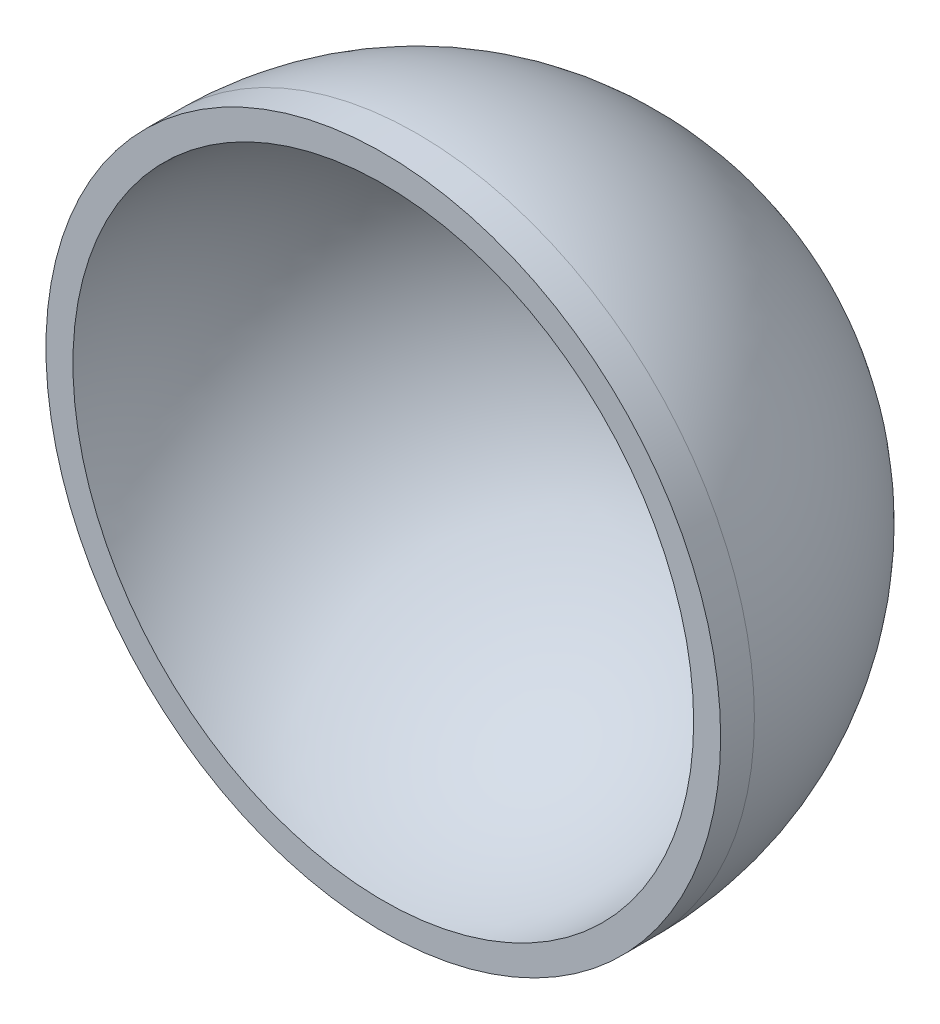
ISO-10303-21;
HEADER;
FILE_DESCRIPTION(('STEP AP214'),'2;1');
FILE_NAME('part.step','',(''),(''),'','','');
FILE_SCHEMA(('AUTOMOTIVE_DESIGN { 1 0 10303 214 1 1 1 1 }'));
ENDSEC;
DATA;
#1=APPLICATION_CONTEXT('core data for automotive mechanical design processes');
#2=APPLICATION_PROTOCOL_DEFINITION('international standard','automotive_design',2000,#1);
#3=PRODUCT_CONTEXT('',#1,'mechanical');
#4=PRODUCT('Part','Part','',(#3));
#5=PRODUCT_RELATED_PRODUCT_CATEGORY('part','',(#4));
#6=PRODUCT_DEFINITION_FORMATION('','',#4);
#7=PRODUCT_DEFINITION_CONTEXT('part definition',#1,'design');
#8=PRODUCT_DEFINITION('design','',#6,#7);
#9=PRODUCT_DEFINITION_SHAPE('','',#8);
#10=(LENGTH_UNIT() NAMED_UNIT(*) SI_UNIT(.MILLI.,.METRE.));
#11=(NAMED_UNIT(*) PLANE_ANGLE_UNIT() SI_UNIT($,.RADIAN.));
#12=(NAMED_UNIT(*) SI_UNIT($,.STERADIAN.) SOLID_ANGLE_UNIT());
#13=UNCERTAINTY_MEASURE_WITH_UNIT(LENGTH_MEASURE(1.E-05),#10,'distance_accuracy_value','');
#14=(GEOMETRIC_REPRESENTATION_CONTEXT(3) GLOBAL_UNCERTAINTY_ASSIGNED_CONTEXT((#13)) GLOBAL_UNIT_ASSIGNED_CONTEXT((#10,
#11,#12)) REPRESENTATION_CONTEXT('',''));
#15=CARTESIAN_POINT('',(0.,0.,0.));
#16=DIRECTION('',(0.,0.,1.));
#17=DIRECTION('',(1.,0.,0.));
#18=AXIS2_PLACEMENT_3D('',#15,#16,#17);
#19=CARTESIAN_POINT('',(0.,0.,-5.));
#20=DIRECTION('',(0.,0.,1.));
#21=DIRECTION('',(1.,0.,0.));
#22=AXIS2_PLACEMENT_3D('',#19,#20,#21);
#23=CYLINDRICAL_SURFACE('',#22,50.);
#24=CARTESIAN_POINT('',(0.,0.,-5.));
#25=DIRECTION('',(0.,0.,1.));
#26=DIRECTION('',(-1.,0.,0.));
#27=AXIS2_PLACEMENT_3D('',#24,#25,#26);
#28=CIRCLE('',#27,50.);
#29=CARTESIAN_POINT('',(-50.,0.,-5.00000000000035));
#30=VERTEX_POINT('',#29);
#31=EDGE_CURVE('E46',#30,#30,#28,.T.);
#32=ORIENTED_EDGE('',*,*,#31,.T.);
#33=EDGE_LOOP('',(#32));
#34=FACE_BOUND('',#33,.T.);
#35=CARTESIAN_POINT('',(0.,0.,0.));
#36=DIRECTION('',(0.,0.,1.));
#37=DIRECTION('',(1.,0.,0.));
#38=AXIS2_PLACEMENT_3D('',#35,#36,#37);
#39=CIRCLE('',#38,50.);
#40=CARTESIAN_POINT('',(50.,0.,0.));
#41=VERTEX_POINT('',#40);
#42=EDGE_CURVE('E10',#41,#41,#39,.T.);
#43=ORIENTED_EDGE('',*,*,#42,.F.);
#44=EDGE_LOOP('',(#43));
#45=FACE_BOUND('',#44,.T.);
#46=ADVANCED_FACE('F39',(#34,#45),#23,.T.);
#47=CARTESIAN_POINT('',(0.,0.,0.));
#48=DIRECTION('',(0.,0.,1.));
#49=DIRECTION('',(1.,0.,0.));
#50=AXIS2_PLACEMENT_3D('',#47,#48,#49);
#51=PLANE('',#50);
#52=CARTESIAN_POINT('',(0.,0.,0.));
#53=DIRECTION('',(0.,0.,1.));
#54=DIRECTION('',(1.,0.,0.));
#55=AXIS2_PLACEMENT_3D('',#52,#53,#54);
#56=CIRCLE('',#55,46.);
#57=CARTESIAN_POINT('',(46.,0.,0.));
#58=VERTEX_POINT('',#57);
#59=EDGE_CURVE('E42',#58,#58,#56,.F.);
#60=ORIENTED_EDGE('',*,*,#59,.T.);
#61=EDGE_LOOP('',(#60));
#62=FACE_BOUND('',#61,.T.);
#63=ORIENTED_EDGE('',*,*,#42,.T.);
#64=EDGE_LOOP('',(#63));
#65=FACE_BOUND('',#64,.T.);
#66=ADVANCED_FACE('F56',(#62,#65),#51,.T.);
#67=CARTESIAN_POINT('',(0.,0.,-5.));
#68=DIRECTION('',(0.,1.,0.));
#69=DIRECTION('',(1.,0.,0.));
#70=AXIS2_PLACEMENT_3D('',#67,#68,#69);
#71=SPHERICAL_SURFACE('',#70,50.);
#72=CARTESIAN_POINT('',(0.,0.,-5.));
#73=DIRECTION('',(0.,0.,1.));
#74=DIRECTION('',(-1.,0.,0.));
#75=AXIS2_PLACEMENT_3D('',#72,#73,#74);
#76=SPHERICAL_SURFACE('',#75,50.);
#77=ORIENTED_EDGE('',*,*,#31,.F.);
#78=EDGE_LOOP('',(#77));
#79=FACE_BOUND('',#78,.T.);
#80=ADVANCED_FACE('F60',(#79),#76,.T.);
#81=CARTESIAN_POINT('',(0.,0.,0.));
#82=DIRECTION('',(0.,1.,0.));
#83=DIRECTION('',(1.,0.,0.));
#84=AXIS2_PLACEMENT_3D('',#81,#82,#83);
#85=SPHERICAL_SURFACE('',#84,46.);
#86=CARTESIAN_POINT('',(0.,0.,0.));
#87=DIRECTION('',(0.,0.,1.));
#88=DIRECTION('',(1.,0.,0.));
#89=AXIS2_PLACEMENT_3D('',#86,#87,#88);
#90=SPHERICAL_SURFACE('',#89,46.);
#91=ORIENTED_EDGE('',*,*,#59,.F.);
#92=EDGE_LOOP('',(#91));
#93=FACE_BOUND('',#92,.T.);
#94=ADVANCED_FACE('F58',(#93),#90,.F.);
#95=CLOSED_SHELL('',(#46,#66,#80,#94));
#96=MANIFOLD_SOLID_BREP('B2',#95);
#97=ADVANCED_BREP_SHAPE_REPRESENTATION('',(#18,#96),#14);
#98=SHAPE_DEFINITION_REPRESENTATION(#9,#97);
ENDSEC;
END-ISO-10303-21;
